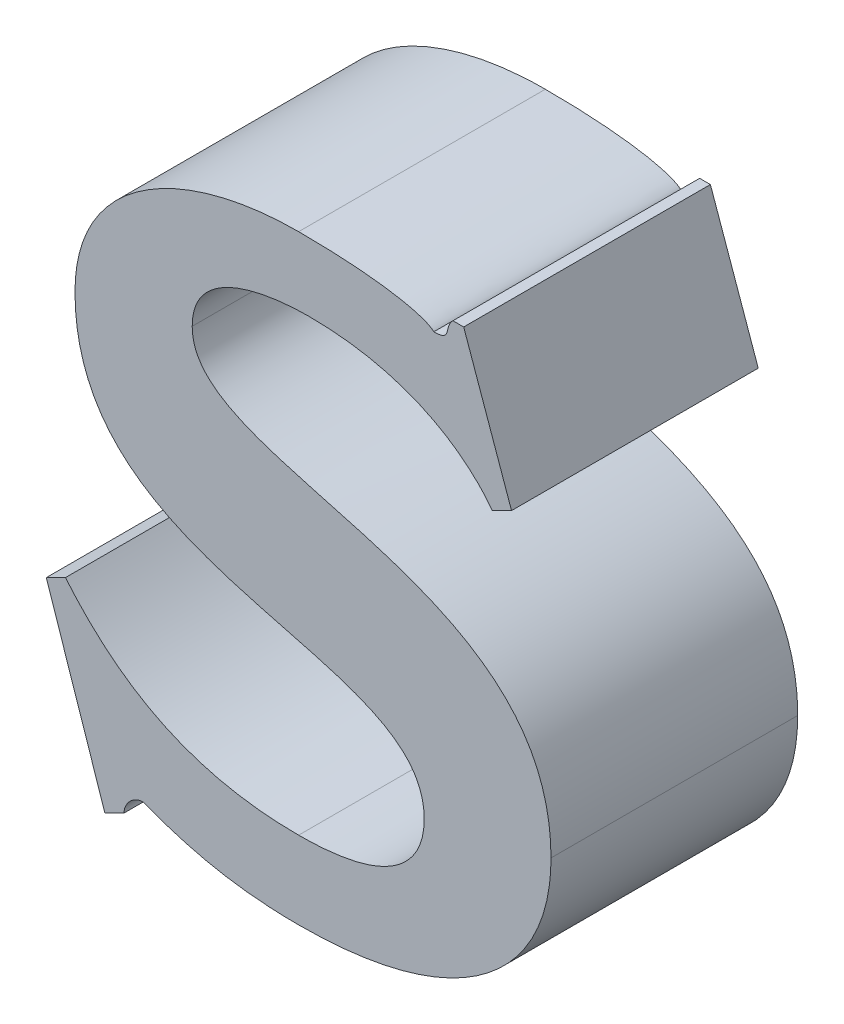
ISO-10303-21;
HEADER;
FILE_DESCRIPTION(('STEP AP214'),'2;1');
FILE_NAME('part.step','',(''),(''),'','','');
FILE_SCHEMA(('AUTOMOTIVE_DESIGN { 1 0 10303 214 1 1 1 1 }'));
ENDSEC;
DATA;
#1=APPLICATION_CONTEXT('core data for automotive mechanical design processes');
#2=APPLICATION_PROTOCOL_DEFINITION('international standard','automotive_design',2000,#1);
#3=PRODUCT_CONTEXT('',#1,'mechanical');
#4=PRODUCT('Part','Part','',(#3));
#5=PRODUCT_RELATED_PRODUCT_CATEGORY('part','',(#4));
#6=PRODUCT_DEFINITION_FORMATION('','',#4);
#7=PRODUCT_DEFINITION_CONTEXT('part definition',#1,'design');
#8=PRODUCT_DEFINITION('design','',#6,#7);
#9=PRODUCT_DEFINITION_SHAPE('','',#8);
#10=(LENGTH_UNIT() NAMED_UNIT(*) SI_UNIT(.MILLI.,.METRE.));
#11=(NAMED_UNIT(*) PLANE_ANGLE_UNIT() SI_UNIT($,.RADIAN.));
#12=(NAMED_UNIT(*) SI_UNIT($,.STERADIAN.) SOLID_ANGLE_UNIT());
#13=UNCERTAINTY_MEASURE_WITH_UNIT(LENGTH_MEASURE(1.E-05),#10,'distance_accuracy_value','');
#14=(GEOMETRIC_REPRESENTATION_CONTEXT(3) GLOBAL_UNCERTAINTY_ASSIGNED_CONTEXT((#13)) GLOBAL_UNIT_ASSIGNED_CONTEXT((#10,
#11,#12)) REPRESENTATION_CONTEXT('',''));
#15=CARTESIAN_POINT('',(0.,0.,0.));
#16=DIRECTION('',(0.,0.,1.));
#17=DIRECTION('',(1.,0.,0.));
#18=AXIS2_PLACEMENT_3D('',#15,#16,#17);
#19=CARTESIAN_POINT('',(3.0463504415638,0.00170300180043131,0.));
#20=DIRECTION('',(-0.447147128615408,0.894460421355241,0.));
#21=DIRECTION('',(-0.894460421355241,-0.447147128615408,0.));
#22=AXIS2_PLACEMENT_3D('',#19,#20,#21);
#23=PLANE('',#22);
#24=DIRECTION('',(0.894460421355241,0.447147128615408,0.));
#25=VECTOR('',#24,1.);
#26=CARTESIAN_POINT('',(3.0385924973305,-0.00217524971863377,0.));
#27=LINE('',#26,#25);
#28=CARTESIAN_POINT('',(3.0385924973305,-0.00217524971863377,0.));
#29=VERTEX_POINT('',#28);
#30=CARTESIAN_POINT('',(3.0463504415637,0.00170300180043131,0.));
#31=VERTEX_POINT('',#30);
#32=EDGE_CURVE('E11',#29,#31,#27,.T.);
#33=ORIENTED_EDGE('',*,*,#32,.F.);
#34=DIRECTION('',(0.,0.,1.));
#35=VECTOR('',#34,1.);
#36=CARTESIAN_POINT('',(3.0385924973305,-0.00217524971863377,0.));
#37=LINE('',#36,#35);
#38=CARTESIAN_POINT('',(3.0385924973305,-0.00217524971863377,0.1));
#39=VERTEX_POINT('',#38);
#40=EDGE_CURVE('E24',#29,#39,#37,.T.);
#41=ORIENTED_EDGE('',*,*,#40,.T.);
#42=DIRECTION('',(-0.894460421355241,-0.447147128615408,0.));
#43=VECTOR('',#42,1.);
#44=CARTESIAN_POINT('',(3.0385924973305,-0.00217524971863377,0.1));
#45=LINE('',#44,#43);
#46=CARTESIAN_POINT('',(3.0463504415637,0.00170300180043131,0.1));
#47=VERTEX_POINT('',#46);
#48=EDGE_CURVE('E160',#47,#39,#45,.T.);
#49=ORIENTED_EDGE('',*,*,#48,.F.);
#50=DIRECTION('',(0.,0.,1.));
#51=VECTOR('',#50,1.);
#52=CARTESIAN_POINT('',(3.0463504415637,0.00170300180043131,0.));
#53=LINE('',#52,#51);
#54=EDGE_CURVE('E398',#31,#47,#53,.T.);
#55=ORIENTED_EDGE('',*,*,#54,.F.);
#56=EDGE_LOOP('',(#33,#41,#49,#55));
#57=FACE_BOUND('',#56,.T.);
#58=ADVANCED_FACE('F17',(#57),#23,.T.);
#59=CARTESIAN_POINT('',(3.1408808407212,-0.0414418257613394,0.));
#60=CARTESIAN_POINT('',(3.1408808407212,-0.0414418257613394,0.1));
#61=CARTESIAN_POINT('',(3.0938568608924,-0.0414418257613952,0.));
#62=CARTESIAN_POINT('',(3.0938568608924,-0.0414418257613952,0.1));
#63=CARTESIAN_POINT('',(3.066225579858,-0.0220509284601061,0.));
#64=CARTESIAN_POINT('',(3.066225579858,-0.0220509284601061,0.1));
#65=CARTESIAN_POINT('',(3.0463504415637,0.00170300180043131,0.));
#66=CARTESIAN_POINT('',(3.0463504415637,0.00170300180043131,0.1));
#67=B_SPLINE_SURFACE_WITH_KNOTS('',3,1,((#59,#60),(#61,#62),(#63,#64),(#65,#66)),.UNSPECIFIED.,
.F.,.F.,.F.,(4,4),(2,2),(-1.,0.),(0.,0.01),.UNSPECIFIED.);
#68=CARTESIAN_POINT('',(3.0463504415637,0.00170300180043131,0.));
#69=CARTESIAN_POINT('',(3.066225579858,-0.0220509284601061,0.));
#70=CARTESIAN_POINT('',(3.0938568608924,-0.0414418257613952,0.));
#71=CARTESIAN_POINT('',(3.1408808407212,-0.0414418257613394,0.));
#72=B_SPLINE_CURVE_WITH_KNOTS('',3,(#68,#69,#70,#71),.UNSPECIFIED.,.F.,.F.,(4,4),(0.,1.),.UNSPECIFIED.);
#73=CARTESIAN_POINT('',(3.1408808407212,-0.0414418257613394,0.));
#74=VERTEX_POINT('',#73);
#75=EDGE_CURVE('E391',#31,#74,#72,.T.);
#76=CARTESIAN_POINT('',(3.1408808407212,-0.0414418257613394,0.1));
#77=CARTESIAN_POINT('',(3.0938568608924,-0.0414418257613952,0.1));
#78=CARTESIAN_POINT('',(3.066225579858,-0.0220509284601061,0.1));
#79=CARTESIAN_POINT('',(3.0463504415637,0.00170300180043131,0.1));
#80=B_SPLINE_CURVE_WITH_KNOTS('',3,(#76,#77,#78,#79),.UNSPECIFIED.,.F.,.F.,(4,4),(-1.,0.),.UNSPECIFIED.);
#81=CARTESIAN_POINT('',(3.1408808407212,-0.0414418257613394,0.1));
#82=VERTEX_POINT('',#81);
#83=EDGE_CURVE('E387',#82,#47,#80,.T.);
#84=DIRECTION('',(0.,0.,1.));
#85=VECTOR('',#84,1.);
#86=CARTESIAN_POINT('',(3.1408808407212,-0.0414418257613394,0.));
#87=LINE('',#86,#85);
#88=EDGE_CURVE('E381',#74,#82,#87,.T.);
#89=ORIENTED_EDGE('',*,*,#75,.F.);
#90=ORIENTED_EDGE('',*,*,#54,.T.);
#91=ORIENTED_EDGE('',*,*,#83,.F.);
#92=ORIENTED_EDGE('',*,*,#88,.F.);
#93=EDGE_LOOP('',(#89,#90,#91,#92));
#94=FACE_BOUND('',#93,.T.);
#95=ADVANCED_FACE('F463',(#94),#67,.T.);
#96=CARTESIAN_POINT('',(3.1917809102784,-0.0104162819904138,0.));
#97=CARTESIAN_POINT('',(3.1917809102784,-0.0104162819904138,0.1));
#98=CARTESIAN_POINT('',(3.1917809108365,-0.0259290376917904,0.));
#99=CARTESIAN_POINT('',(3.1917809108365,-0.0259290376917904,0.1));
#100=CARTESIAN_POINT('',(3.1801472366141,-0.0414418271739219,0.));
#101=CARTESIAN_POINT('',(3.1801472366141,-0.0414418271739219,0.1));
#102=CARTESIAN_POINT('',(3.1408808407212,-0.0414418257613394,0.));
#103=CARTESIAN_POINT('',(3.1408808407212,-0.0414418257613394,0.1));
#104=B_SPLINE_SURFACE_WITH_KNOTS('',3,1,((#96,#97),(#98,#99),(#100,#101),(#102,#103)),
.UNSPECIFIED.,.F.,.F.,.F.,(4,4),(2,2),(-1.,0.),(0.,0.01),.UNSPECIFIED.);
#105=CARTESIAN_POINT('',(3.1408808407212,-0.0414418257613394,0.));
#106=CARTESIAN_POINT('',(3.1801472366141,-0.0414418271739219,0.));
#107=CARTESIAN_POINT('',(3.1917809108365,-0.0259290376917904,0.));
#108=CARTESIAN_POINT('',(3.1917809102784,-0.0104162819904138,0.));
#109=B_SPLINE_CURVE_WITH_KNOTS('',3,(#105,#106,#107,#108),.UNSPECIFIED.,.F.,.F.,(4,4),(0.,1.),.UNSPECIFIED.);
#110=CARTESIAN_POINT('',(3.1917809102784,-0.0104162819904138,0.));
#111=VERTEX_POINT('',#110);
#112=EDGE_CURVE('E374',#74,#111,#109,.T.);
#113=CARTESIAN_POINT('',(3.1917809102784,-0.0104162819904138,0.1));
#114=CARTESIAN_POINT('',(3.1917809108365,-0.0259290376917904,0.1));
#115=CARTESIAN_POINT('',(3.1801472366141,-0.0414418271739219,0.1));
#116=CARTESIAN_POINT('',(3.1408808407212,-0.0414418257613394,0.1));
#117=B_SPLINE_CURVE_WITH_KNOTS('',3,(#113,#114,#115,#116),.UNSPECIFIED.,.F.,.F.,(4,4),(-1.,0.),.UNSPECIFIED.);
#118=CARTESIAN_POINT('',(3.1917809102784,-0.0104162819904138,0.1));
#119=VERTEX_POINT('',#118);
#120=EDGE_CURVE('E369',#119,#82,#117,.T.);
#121=DIRECTION('',(0.,0.,1.));
#122=VECTOR('',#121,1.);
#123=CARTESIAN_POINT('',(3.1917809102784,-0.0104162819904138,0.));
#124=LINE('',#123,#122);
#125=EDGE_CURVE('E363',#111,#119,#124,.T.);
#126=ORIENTED_EDGE('',*,*,#112,.F.);
#127=ORIENTED_EDGE('',*,*,#88,.T.);
#128=ORIENTED_EDGE('',*,*,#120,.F.);
#129=ORIENTED_EDGE('',*,*,#125,.F.);
#130=EDGE_LOOP('',(#126,#127,#128,#129));
#131=FACE_BOUND('',#130,.T.);
#132=ADVANCED_FACE('F459',(#131),#104,.T.);
#133=CARTESIAN_POINT('',(3.0502276121888,0.103989940027366,0.));
#134=CARTESIAN_POINT('',(3.0502276121888,0.103989940027366,0.1));
#135=CARTESIAN_POINT('',(3.0502276124849,0.00945925474084119,0.));
#136=CARTESIAN_POINT('',(3.0502276124849,0.00945925474084119,0.1));
#137=CARTESIAN_POINT('',(3.1917809111018,0.0448477212741324,0.));
#138=CARTESIAN_POINT('',(3.1917809111018,0.0448477212741324,0.1));
#139=CARTESIAN_POINT('',(3.1917809102784,-0.0104162819904138,0.));
#140=CARTESIAN_POINT('',(3.1917809102784,-0.0104162819904138,0.1));
#141=B_SPLINE_SURFACE_WITH_KNOTS('',3,1,((#133,#134),(#135,#136),(#137,#138),(#139,#140)),
.UNSPECIFIED.,.F.,.F.,.F.,(4,4),(2,2),(-1.,0.),(0.,0.01),.UNSPECIFIED.);
#142=CARTESIAN_POINT('',(3.1917809102784,-0.0104162819904138,0.));
#143=CARTESIAN_POINT('',(3.1917809111018,0.0448477212741324,0.));
#144=CARTESIAN_POINT('',(3.0502276124849,0.0094592547408412,0.));
#145=CARTESIAN_POINT('',(3.0502276121888,0.103989940027366,0.));
#146=B_SPLINE_CURVE_WITH_KNOTS('',3,(#142,#143,#144,#145),.UNSPECIFIED.,.F.,.F.,(4,4),(0.,1.),.UNSPECIFIED.);
#147=CARTESIAN_POINT('',(3.0502276121888,0.103989940027366,0.));
#148=VERTEX_POINT('',#147);
#149=EDGE_CURVE('E356',#111,#148,#146,.T.);
#150=CARTESIAN_POINT('',(3.0502276121888,0.103989940027366,0.1));
#151=CARTESIAN_POINT('',(3.0502276124849,0.0094592547408412,0.1));
#152=CARTESIAN_POINT('',(3.1917809111018,0.0448477212741324,0.1));
#153=CARTESIAN_POINT('',(3.1917809102784,-0.0104162819904138,0.1));
#154=B_SPLINE_CURVE_WITH_KNOTS('',3,(#150,#151,#152,#153),.UNSPECIFIED.,.F.,.F.,(4,4),(-1.,0.),.UNSPECIFIED.);
#155=CARTESIAN_POINT('',(3.0502276121888,0.103989940027366,0.1));
#156=VERTEX_POINT('',#155);
#157=EDGE_CURVE('E351',#156,#119,#154,.T.);
#158=DIRECTION('',(0.,0.,1.));
#159=VECTOR('',#158,1.);
#160=CARTESIAN_POINT('',(3.0502276121888,0.103989940027366,0.));
#161=LINE('',#160,#159);
#162=EDGE_CURVE('E345',#148,#156,#161,.T.);
#163=ORIENTED_EDGE('',*,*,#149,.F.);
#164=ORIENTED_EDGE('',*,*,#125,.T.);
#165=ORIENTED_EDGE('',*,*,#157,.F.);
#166=ORIENTED_EDGE('',*,*,#162,.F.);
#167=EDGE_LOOP('',(#163,#164,#165,#166));
#168=FACE_BOUND('',#167,.T.);
#169=ADVANCED_FACE('F455',(#168),#141,.T.);
#170=CARTESIAN_POINT('',(3.1408808407212,0.170403808321217,0.));
#171=CARTESIAN_POINT('',(3.1408808407212,0.170403808321217,0.1));
#172=CARTESIAN_POINT('',(3.0938568604829,0.170403808590567,0.));
#173=CARTESIAN_POINT('',(3.0938568604829,0.170403808590567,0.1));
#174=CARTESIAN_POINT('',(3.0502276119226,0.147134659499865,0.));
#175=CARTESIAN_POINT('',(3.0502276119226,0.147134659499865,0.1));
#176=CARTESIAN_POINT('',(3.0502276121888,0.103989940027366,0.));
#177=CARTESIAN_POINT('',(3.0502276121888,0.103989940027366,0.1));
#178=B_SPLINE_SURFACE_WITH_KNOTS('',3,1,((#170,#171),(#172,#173),(#174,#175),(#176,#177)),
.UNSPECIFIED.,.F.,.F.,.F.,(4,4),(2,2),(-1.,0.),(0.,0.01),.UNSPECIFIED.);
#179=CARTESIAN_POINT('',(3.0502276121888,0.103989940027366,0.));
#180=CARTESIAN_POINT('',(3.0502276119226,0.147134659499865,0.));
#181=CARTESIAN_POINT('',(3.0938568604829,0.170403808590567,0.));
#182=CARTESIAN_POINT('',(3.1408808407212,0.170403808321217,0.));
#183=B_SPLINE_CURVE_WITH_KNOTS('',3,(#179,#180,#181,#182),.UNSPECIFIED.,.F.,.F.,(4,4),(0.,1.),.UNSPECIFIED.);
#184=CARTESIAN_POINT('',(3.1408808407212,0.170403808321217,0.));
#185=VERTEX_POINT('',#184);
#186=EDGE_CURVE('E338',#148,#185,#183,.T.);
#187=CARTESIAN_POINT('',(3.1408808407212,0.170403808321217,0.1));
#188=CARTESIAN_POINT('',(3.0938568604829,0.170403808590567,0.1));
#189=CARTESIAN_POINT('',(3.0502276119226,0.147134659499865,0.1));
#190=CARTESIAN_POINT('',(3.0502276121888,0.103989940027366,0.1));
#191=B_SPLINE_CURVE_WITH_KNOTS('',3,(#187,#188,#189,#190),.UNSPECIFIED.,.F.,.F.,(4,4),(-1.,0.),.UNSPECIFIED.);
#192=CARTESIAN_POINT('',(3.1408808407212,0.170403808321217,0.1));
#193=VERTEX_POINT('',#192);
#194=EDGE_CURVE('E333',#193,#156,#191,.T.);
#195=DIRECTION('',(0.,0.,1.));
#196=VECTOR('',#195,1.);
#197=CARTESIAN_POINT('',(3.1408808407212,0.170403808321217,0.));
#198=LINE('',#197,#196);
#199=EDGE_CURVE('E327',#185,#193,#198,.T.);
#200=ORIENTED_EDGE('',*,*,#186,.F.);
#201=ORIENTED_EDGE('',*,*,#162,.T.);
#202=ORIENTED_EDGE('',*,*,#194,.F.);
#203=ORIENTED_EDGE('',*,*,#199,.F.);
#204=EDGE_LOOP('',(#200,#201,#202,#203));
#205=FACE_BOUND('',#204,.T.);
#206=ADVANCED_FACE('F451',(#205),#178,.T.);
#207=CARTESIAN_POINT('',(3.1956598823951,0.162647413370297,0.));
#208=CARTESIAN_POINT('',(3.1956598823951,0.162647413370297,0.1));
#209=CARTESIAN_POINT('',(3.1917809103021,0.166525701234888,0.));
#210=CARTESIAN_POINT('',(3.1917809103021,0.166525701234888,0.1));
#211=CARTESIAN_POINT('',(3.1723910938727,0.170403808515751,0.));
#212=CARTESIAN_POINT('',(3.1723910938727,0.170403808515751,0.1));
#213=CARTESIAN_POINT('',(3.1408808407212,0.170403808321217,0.));
#214=CARTESIAN_POINT('',(3.1408808407212,0.170403808321217,0.1));
#215=B_SPLINE_SURFACE_WITH_KNOTS('',3,1,((#207,#208),(#209,#210),(#211,#212),(#213,#214)),
.UNSPECIFIED.,.F.,.F.,.F.,(4,4),(2,2),(-1.,0.),(0.,0.01),.UNSPECIFIED.);
#216=CARTESIAN_POINT('',(3.1408808407212,0.170403808321217,0.));
#217=CARTESIAN_POINT('',(3.1723910938727,0.170403808515751,0.));
#218=CARTESIAN_POINT('',(3.1917809103021,0.166525701234888,0.));
#219=CARTESIAN_POINT('',(3.1956598823951,0.162647413370297,0.));
#220=B_SPLINE_CURVE_WITH_KNOTS('',3,(#216,#217,#218,#219),.UNSPECIFIED.,.F.,.F.,(4,4),(0.,1.),.UNSPECIFIED.);
#221=CARTESIAN_POINT('',(3.1956598823951,0.162647413370297,0.));
#222=VERTEX_POINT('',#221);
#223=EDGE_CURVE('E320',#185,#222,#220,.T.);
#224=CARTESIAN_POINT('',(3.1956598823951,0.162647413370297,0.1));
#225=CARTESIAN_POINT('',(3.1917809103021,0.166525701234888,0.1));
#226=CARTESIAN_POINT('',(3.1723910938727,0.170403808515751,0.1));
#227=CARTESIAN_POINT('',(3.1408808407212,0.170403808321217,0.1));
#228=B_SPLINE_CURVE_WITH_KNOTS('',3,(#224,#225,#226,#227),.UNSPECIFIED.,.F.,.F.,(4,4),(-1.,0.),.UNSPECIFIED.);
#229=CARTESIAN_POINT('',(3.1956598823951,0.162647413370297,0.1));
#230=VERTEX_POINT('',#229);
#231=EDGE_CURVE('E315',#230,#193,#228,.T.);
#232=DIRECTION('',(0.,0.,1.));
#233=VECTOR('',#232,1.);
#234=CARTESIAN_POINT('',(3.1956598823951,0.162647413370297,0.));
#235=LINE('',#234,#233);
#236=EDGE_CURVE('E309',#222,#230,#235,.T.);
#237=ORIENTED_EDGE('',*,*,#223,.F.);
#238=ORIENTED_EDGE('',*,*,#199,.T.);
#239=ORIENTED_EDGE('',*,*,#231,.F.);
#240=ORIENTED_EDGE('',*,*,#236,.F.);
#241=EDGE_LOOP('',(#237,#238,#239,#240));
#242=FACE_BOUND('',#241,.T.);
#243=ADVANCED_FACE('F447',(#242),#215,.T.);
#244=CARTESIAN_POINT('',(3.2034160251367,0.170403808321217,0.));
#245=CARTESIAN_POINT('',(3.2034160251367,0.170403808321217,0.1));
#246=CARTESIAN_POINT('',(3.1995370530197,0.166525700920871,0.));
#247=CARTESIAN_POINT('',(3.1995370530197,0.166525700920871,0.1));
#248=CARTESIAN_POINT('',(3.2034160251369,0.162647413370146,0.));
#249=CARTESIAN_POINT('',(3.2034160251369,0.162647413370146,0.1));
#250=CARTESIAN_POINT('',(3.1956598823951,0.162647413370297,0.));
#251=CARTESIAN_POINT('',(3.1956598823951,0.162647413370297,0.1));
#252=B_SPLINE_SURFACE_WITH_KNOTS('',3,1,((#244,#245),(#246,#247),(#248,#249),(#250,#251)),
.UNSPECIFIED.,.F.,.F.,.F.,(4,4),(2,2),(-1.,0.),(0.,0.01),.UNSPECIFIED.);
#253=CARTESIAN_POINT('',(3.1956598823951,0.162647413370297,0.));
#254=CARTESIAN_POINT('',(3.2034160251369,0.162647413370146,0.));
#255=CARTESIAN_POINT('',(3.1995370530197,0.166525700920871,0.));
#256=CARTESIAN_POINT('',(3.2034160251367,0.170403808321217,0.));
#257=B_SPLINE_CURVE_WITH_KNOTS('',3,(#253,#254,#255,#256),.UNSPECIFIED.,.F.,.F.,(4,4),(0.,1.),.UNSPECIFIED.);
#258=CARTESIAN_POINT('',(3.2034160251367,0.170403808321217,0.));
#259=VERTEX_POINT('',#258);
#260=EDGE_CURVE('E302',#222,#259,#257,.T.);
#261=CARTESIAN_POINT('',(3.2034160251367,0.170403808321217,0.1));
#262=CARTESIAN_POINT('',(3.1995370530197,0.166525700920871,0.1));
#263=CARTESIAN_POINT('',(3.2034160251369,0.162647413370146,0.1));
#264=CARTESIAN_POINT('',(3.1956598823951,0.162647413370297,0.1));
#265=B_SPLINE_CURVE_WITH_KNOTS('',3,(#261,#262,#263,#264),.UNSPECIFIED.,.F.,.F.,(4,4),(-1.,0.),.UNSPECIFIED.);
#266=CARTESIAN_POINT('',(3.2034160251367,0.170403808321217,0.1));
#267=VERTEX_POINT('',#266);
#268=EDGE_CURVE('E297',#267,#230,#265,.T.);
#269=DIRECTION('',(0.,0.,1.));
#270=VECTOR('',#269,1.);
#271=CARTESIAN_POINT('',(3.2034160251367,0.170403808321217,0.));
#272=LINE('',#271,#270);
#273=EDGE_CURVE('E294',#259,#267,#272,.T.);
#274=ORIENTED_EDGE('',*,*,#260,.F.);
#275=ORIENTED_EDGE('',*,*,#236,.T.);
#276=ORIENTED_EDGE('',*,*,#268,.F.);
#277=ORIENTED_EDGE('',*,*,#273,.F.);
#278=EDGE_LOOP('',(#274,#275,#276,#277));
#279=FACE_BOUND('',#278,.T.);
#280=ADVANCED_FACE('F443',(#279),#252,.T.);
#281=CARTESIAN_POINT('',(3.2077785176488,0.170403808321217,0.));
#282=DIRECTION('',(0.,1.,0.));
#283=DIRECTION('',(-1.,0.,0.));
#284=AXIS2_PLACEMENT_3D('',#281,#282,#283);
#285=PLANE('',#284);
#286=DIRECTION('',(1.,0.,0.));
#287=VECTOR('',#286,1.);
#288=CARTESIAN_POINT('',(3.2034160251367,0.170403808321217,0.));
#289=LINE('',#288,#287);
#290=CARTESIAN_POINT('',(3.2077785176488,0.170403808321217,0.));
#291=VERTEX_POINT('',#290);
#292=EDGE_CURVE('E292',#259,#291,#289,.T.);
#293=ORIENTED_EDGE('',*,*,#292,.F.);
#294=ORIENTED_EDGE('',*,*,#273,.T.);
#295=DIRECTION('',(-1.,0.,0.));
#296=VECTOR('',#295,1.);
#297=CARTESIAN_POINT('',(3.2034160251367,0.170403808321217,0.1));
#298=LINE('',#297,#296);
#299=CARTESIAN_POINT('',(3.2077785176488,0.170403808321217,0.1));
#300=VERTEX_POINT('',#299);
#301=EDGE_CURVE('E289',#300,#267,#298,.T.);
#302=ORIENTED_EDGE('',*,*,#301,.F.);
#303=DIRECTION('',(0.,0.,1.));
#304=VECTOR('',#303,1.);
#305=CARTESIAN_POINT('',(3.2077785176488,0.170403808321217,0.));
#306=LINE('',#305,#304);
#307=EDGE_CURVE('E286',#291,#300,#306,.T.);
#308=ORIENTED_EDGE('',*,*,#307,.F.);
#309=EDGE_LOOP('',(#293,#294,#302,#308));
#310=FACE_BOUND('',#309,.T.);
#311=ADVANCED_FACE('F439',(#310),#285,.T.);
#312=CARTESIAN_POINT('',(3.2271701355464,0.115624478407832,0.));
#313=DIRECTION('',(0.942678091152359,0.333703485839368,0.));
#314=DIRECTION('',(-0.333703485839368,0.942678091152359,0.));
#315=AXIS2_PLACEMENT_3D('',#312,#313,#314);
#316=PLANE('',#315);
#317=DIRECTION('',(0.333703485839368,-0.942678091152359,0.));
#318=VECTOR('',#317,1.);
#319=CARTESIAN_POINT('',(3.2077785176488,0.170403808321217,0.));
#320=LINE('',#319,#318);
#321=CARTESIAN_POINT('',(3.2271701355464,0.115624478407832,0.));
#322=VERTEX_POINT('',#321);
#323=EDGE_CURVE('E284',#291,#322,#320,.T.);
#324=ORIENTED_EDGE('',*,*,#323,.F.);
#325=ORIENTED_EDGE('',*,*,#307,.T.);
#326=DIRECTION('',(-0.333703485839368,0.942678091152359,0.));
#327=VECTOR('',#326,1.);
#328=CARTESIAN_POINT('',(3.2077785176488,0.170403808321217,0.1));
#329=LINE('',#328,#327);
#330=CARTESIAN_POINT('',(3.2271701355464,0.115624478407832,0.1));
#331=VERTEX_POINT('',#330);
#332=EDGE_CURVE('E281',#331,#300,#329,.T.);
#333=ORIENTED_EDGE('',*,*,#332,.F.);
#334=DIRECTION('',(0.,0.,1.));
#335=VECTOR('',#334,1.);
#336=CARTESIAN_POINT('',(3.2271701355464,0.115624478407832,0.));
#337=LINE('',#336,#335);
#338=EDGE_CURVE('E278',#322,#331,#337,.T.);
#339=ORIENTED_EDGE('',*,*,#338,.F.);
#340=EDGE_LOOP('',(#324,#325,#333,#339));
#341=FACE_BOUND('',#340,.T.);
#342=ADVANCED_FACE('F435',(#341),#316,.T.);
#343=CARTESIAN_POINT('',(3.2194136325071,0.111746334977132,0.));
#344=DIRECTION('',(0.447203624151044,-0.894432176604896,0.));
#345=DIRECTION('',(0.894432176604896,0.447203624151044,0.));
#346=AXIS2_PLACEMENT_3D('',#343,#344,#345);
#347=PLANE('',#346);
#348=DIRECTION('',(-0.894432176604896,-0.447203624151044,0.));
#349=VECTOR('',#348,1.);
#350=CARTESIAN_POINT('',(3.2271701355464,0.115624478407832,0.));
#351=LINE('',#350,#349);
#352=CARTESIAN_POINT('',(3.2194136325071,0.111746334977132,0.));
#353=VERTEX_POINT('',#352);
#354=EDGE_CURVE('E276',#322,#353,#351,.T.);
#355=ORIENTED_EDGE('',*,*,#354,.F.);
#356=ORIENTED_EDGE('',*,*,#338,.T.);
#357=DIRECTION('',(0.894432176604896,0.447203624151044,0.));
#358=VECTOR('',#357,1.);
#359=CARTESIAN_POINT('',(3.2271701355464,0.115624478407832,0.1));
#360=LINE('',#359,#358);
#361=CARTESIAN_POINT('',(3.2194136325071,0.111746334977132,0.1));
#362=VERTEX_POINT('',#361);
#363=EDGE_CURVE('E273',#362,#331,#360,.T.);
#364=ORIENTED_EDGE('',*,*,#363,.F.);
#365=DIRECTION('',(0.,0.,1.));
#366=VECTOR('',#365,1.);
#367=CARTESIAN_POINT('',(3.2194136325071,0.111746334977132,0.));
#368=LINE('',#367,#366);
#369=EDGE_CURVE('E267',#353,#362,#368,.T.);
#370=ORIENTED_EDGE('',*,*,#369,.F.);
#371=EDGE_LOOP('',(#355,#356,#364,#370));
#372=FACE_BOUND('',#371,.T.);
#373=ADVANCED_FACE('F431',(#372),#347,.T.);
#374=CARTESIAN_POINT('',(3.1447583716438,0.142771734629687,0.));
#375=CARTESIAN_POINT('',(3.1447583716438,0.142771734629687,0.1));
#376=CARTESIAN_POINT('',(3.1623964735484,0.142771737032679,0.));
#377=CARTESIAN_POINT('',(3.1623964735484,0.142771737032679,0.1));
#378=CARTESIAN_POINT('',(3.1769279771014,0.139641980100609,0.));
#379=CARTESIAN_POINT('',(3.1769279771014,0.139641980100609,0.1));
#380=CARTESIAN_POINT('',(3.1951964582252,0.132037886436416,0.));
#381=CARTESIAN_POINT('',(3.1951964582252,0.132037886436416,0.1));
#382=CARTESIAN_POINT('',(3.2013980901704,0.128546218407649,0.));
#383=CARTESIAN_POINT('',(3.2013980901704,0.128546218407649,0.1));
#384=CARTESIAN_POINT('',(3.2116579013345,0.12061844350881,0.));
#385=CARTESIAN_POINT('',(3.2116579013345,0.12061844350881,0.1));
#386=CARTESIAN_POINT('',(3.2158946827333,0.116438057746347,0.));
#387=CARTESIAN_POINT('',(3.2158946827333,0.116438057746347,0.1));
#388=CARTESIAN_POINT('',(3.2194136325071,0.111746334977132,0.));
#389=CARTESIAN_POINT('',(3.2194136325071,0.111746334977132,0.1));
#390=B_SPLINE_SURFACE_WITH_KNOTS('',3,1,((#374,#375),(#376,#377),(#378,#379),(#380,#381),(#382,
#383),(#384,#385),(#386,#387),(#388,#389)),.UNSPECIFIED.,.F.,.F.,.F.,(4,2,2,4),(2,2),
(-0.0066235438387581,-0.0033508001984094,-0.0015233111898169,0.),(0.,0.01),.UNSPECIFIED.);
#391=CARTESIAN_POINT('',(3.2194136325071,0.111746334977132,0.));
#392=CARTESIAN_POINT('',(3.2158946827333,0.116438057746347,0.));
#393=CARTESIAN_POINT('',(3.2116579013345,0.12061844350881,0.));
#394=CARTESIAN_POINT('',(3.2013980901704,0.128546218407649,0.));
#395=CARTESIAN_POINT('',(3.1951964582252,0.132037886436416,0.));
#396=CARTESIAN_POINT('',(3.1769279771014,0.139641980100609,0.));
#397=CARTESIAN_POINT('',(3.1623964735484,0.142771737032679,0.));
#398=CARTESIAN_POINT('',(3.1447583716438,0.142771734629687,0.));
#399=B_SPLINE_CURVE_WITH_KNOTS('',3,(#391,#392,#393,#394,#395,#396,#397,#398),.UNSPECIFIED.,.F.,
.F.,(4,2,2,4),(0.,0.0015233111898169,0.0033508001984094,0.0066235438387581),.UNSPECIFIED.);
#400=CARTESIAN_POINT('',(3.1447583716438,0.142771734629687,0.));
#401=VERTEX_POINT('',#400);
#402=EDGE_CURVE('E260',#353,#401,#399,.T.);
#403=CARTESIAN_POINT('',(3.1447583716438,0.142771734629687,0.1));
#404=CARTESIAN_POINT('',(3.1623964735484,0.142771737032679,0.1));
#405=CARTESIAN_POINT('',(3.1769279771014,0.139641980100609,0.1));
#406=CARTESIAN_POINT('',(3.1951964582252,0.132037886436416,0.1));
#407=CARTESIAN_POINT('',(3.2013980901704,0.128546218407649,0.1));
#408=CARTESIAN_POINT('',(3.2116579013345,0.12061844350881,0.1));
#409=CARTESIAN_POINT('',(3.2158946827333,0.116438057746347,0.1));
#410=CARTESIAN_POINT('',(3.2194136325071,0.111746334977132,0.1));
#411=B_SPLINE_CURVE_WITH_KNOTS('',3,(#403,#404,#405,#406,#407,#408,#409,#410),.UNSPECIFIED.,.F.,
.F.,(4,2,2,4),(-0.0066235438387581,-0.0033508001984094,-0.0015233111898169,0.),.UNSPECIFIED.);
#412=CARTESIAN_POINT('',(3.1447583716438,0.142771734629687,0.1));
#413=VERTEX_POINT('',#412);
#414=EDGE_CURVE('E255',#413,#362,#411,.T.);
#415=DIRECTION('',(0.,0.,1.));
#416=VECTOR('',#415,1.);
#417=CARTESIAN_POINT('',(3.1447583716438,0.142771734629687,0.));
#418=LINE('',#417,#416);
#419=EDGE_CURVE('E249',#401,#413,#418,.T.);
#420=ORIENTED_EDGE('',*,*,#402,.F.);
#421=ORIENTED_EDGE('',*,*,#369,.T.);
#422=ORIENTED_EDGE('',*,*,#414,.F.);
#423=ORIENTED_EDGE('',*,*,#419,.F.);
#424=EDGE_LOOP('',(#420,#421,#422,#423));
#425=FACE_BOUND('',#424,.T.);
#426=ADVANCED_FACE('F427',(#425),#390,.T.);
#427=CARTESIAN_POINT('',(3.0977354727104,0.115624478407832,0.));
#428=CARTESIAN_POINT('',(3.0977354727104,0.115624478407832,0.1));
#429=CARTESIAN_POINT('',(3.0977354725469,0.138893629211212,0.));
#430=CARTESIAN_POINT('',(3.0977354725469,0.138893629211212,0.1));
#431=CARTESIAN_POINT('',(3.1292457258625,0.142771735283506,0.));
#432=CARTESIAN_POINT('',(3.1292457258625,0.142771735283506,0.1));
#433=CARTESIAN_POINT('',(3.1447583716438,0.142771734629687,0.));
#434=CARTESIAN_POINT('',(3.1447583716438,0.142771734629687,0.1));
#435=B_SPLINE_SURFACE_WITH_KNOTS('',3,1,((#427,#428),(#429,#430),(#431,#432),(#433,#434)),
.UNSPECIFIED.,.F.,.F.,.F.,(4,4),(2,2),(-1.,0.),(0.,0.01),.UNSPECIFIED.);
#436=CARTESIAN_POINT('',(3.1447583716438,0.142771734629687,0.));
#437=CARTESIAN_POINT('',(3.1292457258625,0.142771735283506,0.));
#438=CARTESIAN_POINT('',(3.0977354725469,0.138893629211212,0.));
#439=CARTESIAN_POINT('',(3.0977354727104,0.115624478407832,0.));
#440=B_SPLINE_CURVE_WITH_KNOTS('',3,(#436,#437,#438,#439),.UNSPECIFIED.,.F.,.F.,(4,4),(0.,1.),.UNSPECIFIED.);
#441=CARTESIAN_POINT('',(3.0977354727104,0.115624478407832,0.));
#442=VERTEX_POINT('',#441);
#443=EDGE_CURVE('E242',#401,#442,#440,.T.);
#444=CARTESIAN_POINT('',(3.0977354727104,0.115624478407832,0.1));
#445=CARTESIAN_POINT('',(3.0977354725469,0.138893629211212,0.1));
#446=CARTESIAN_POINT('',(3.1292457258625,0.142771735283506,0.1));
#447=CARTESIAN_POINT('',(3.1447583716438,0.142771734629687,0.1));
#448=B_SPLINE_CURVE_WITH_KNOTS('',3,(#444,#445,#446,#447),.UNSPECIFIED.,.F.,.F.,(4,4),(-1.,0.),.UNSPECIFIED.);
#449=CARTESIAN_POINT('',(3.0977354727104,0.115624478407832,0.1));
#450=VERTEX_POINT('',#449);
#451=EDGE_CURVE('E237',#450,#413,#448,.T.);
#452=DIRECTION('',(0.,0.,1.));
#453=VECTOR('',#452,1.);
#454=CARTESIAN_POINT('',(3.0977354727104,0.115624478407832,0.));
#455=LINE('',#454,#453);
#456=EDGE_CURVE('E231',#442,#450,#455,.T.);
#457=ORIENTED_EDGE('',*,*,#443,.F.);
#458=ORIENTED_EDGE('',*,*,#419,.T.);
#459=ORIENTED_EDGE('',*,*,#451,.F.);
#460=ORIENTED_EDGE('',*,*,#456,.F.);
#461=EDGE_LOOP('',(#457,#458,#459,#460));
#462=FACE_BOUND('',#461,.T.);
#463=ADVANCED_FACE('F423',(#462),#435,.T.);
#464=CARTESIAN_POINT('',(3.2431677429167,0.00170300180043131,0.));
#465=CARTESIAN_POINT('',(3.2431677429167,0.00170300180043131,0.1));
#466=CARTESIAN_POINT('',(3.2431677429167,0.095748799667293,0.));
#467=CARTESIAN_POINT('',(3.2431677429167,0.095748799667293,0.1));
#468=CARTESIAN_POINT('',(3.0977354727105,0.0686015074151749,0.));
#469=CARTESIAN_POINT('',(3.0977354727105,0.0686015074151749,0.1));
#470=CARTESIAN_POINT('',(3.0977354727104,0.115624478407832,0.));
#471=CARTESIAN_POINT('',(3.0977354727104,0.115624478407832,0.1));
#472=B_SPLINE_SURFACE_WITH_KNOTS('',3,1,((#464,#465),(#466,#467),(#468,#469),(#470,#471)),
.UNSPECIFIED.,.F.,.F.,.F.,(4,4),(2,2),(-1.,0.),(0.,0.01),.UNSPECIFIED.);
#473=CARTESIAN_POINT('',(3.0977354727104,0.115624478407832,0.));
#474=CARTESIAN_POINT('',(3.0977354727105,0.0686015074151749,0.));
#475=CARTESIAN_POINT('',(3.2431677429167,0.095748799667293,0.));
#476=CARTESIAN_POINT('',(3.2431677429167,0.00170300180043131,0.));
#477=B_SPLINE_CURVE_WITH_KNOTS('',3,(#473,#474,#475,#476),.UNSPECIFIED.,.F.,.F.,(4,4),(0.,1.),.UNSPECIFIED.);
#478=CARTESIAN_POINT('',(3.2431677429167,0.00170300180043131,0.));
#479=VERTEX_POINT('',#478);
#480=EDGE_CURVE('E224',#442,#479,#477,.T.);
#481=CARTESIAN_POINT('',(3.2431677429167,0.00170300180043131,0.1));
#482=CARTESIAN_POINT('',(3.2431677429167,0.095748799667293,0.1));
#483=CARTESIAN_POINT('',(3.0977354727105,0.0686015074151749,0.1));
#484=CARTESIAN_POINT('',(3.0977354727104,0.115624478407832,0.1));
#485=B_SPLINE_CURVE_WITH_KNOTS('',3,(#481,#482,#483,#484),.UNSPECIFIED.,.F.,.F.,(4,4),(-1.,0.),.UNSPECIFIED.);
#486=CARTESIAN_POINT('',(3.2431677429167,0.00170300180043131,0.1));
#487=VERTEX_POINT('',#486);
#488=EDGE_CURVE('E219',#487,#450,#485,.T.);
#489=DIRECTION('',(0.,0.,1.));
#490=VECTOR('',#489,1.);
#491=CARTESIAN_POINT('',(3.2431677429167,0.00170300180043131,0.));
#492=LINE('',#491,#490);
#493=EDGE_CURVE('E213',#479,#487,#492,.T.);
#494=ORIENTED_EDGE('',*,*,#480,.F.);
#495=ORIENTED_EDGE('',*,*,#456,.T.);
#496=ORIENTED_EDGE('',*,*,#488,.F.);
#497=ORIENTED_EDGE('',*,*,#493,.F.);
#498=EDGE_LOOP('',(#494,#495,#496,#497));
#499=FACE_BOUND('',#498,.T.);
#500=ADVANCED_FACE('F419',(#499),#472,.T.);
#501=CARTESIAN_POINT('',(3.1408808407212,-0.0729520068533557,0.));
#502=CARTESIAN_POINT('',(3.1408808407212,-0.0729520068533557,0.1));
#503=CARTESIAN_POINT('',(3.2077785187614,-0.0729520073806107,0.));
#504=CARTESIAN_POINT('',(3.2077785187614,-0.0729520073806107,0.1));
#505=CARTESIAN_POINT('',(3.2431677435597,-0.0414418257613918,0.));
#506=CARTESIAN_POINT('',(3.2431677435597,-0.0414418257613918,0.1));
#507=CARTESIAN_POINT('',(3.2431677429167,0.00170300180043131,0.));
#508=CARTESIAN_POINT('',(3.2431677429167,0.00170300180043131,0.1));
#509=B_SPLINE_SURFACE_WITH_KNOTS('',3,1,((#501,#502),(#503,#504),(#505,#506),(#507,#508)),
.UNSPECIFIED.,.F.,.F.,.F.,(4,4),(2,2),(-1.,0.),(0.,0.01),.UNSPECIFIED.);
#510=CARTESIAN_POINT('',(3.2431677429167,0.00170300180043131,0.));
#511=CARTESIAN_POINT('',(3.2431677435597,-0.0414418257613917,0.));
#512=CARTESIAN_POINT('',(3.2077785187614,-0.0729520073806107,0.));
#513=CARTESIAN_POINT('',(3.1408808407212,-0.0729520068533557,0.));
#514=B_SPLINE_CURVE_WITH_KNOTS('',3,(#510,#511,#512,#513),.UNSPECIFIED.,.F.,.F.,(4,4),(0.,1.),.UNSPECIFIED.);
#515=CARTESIAN_POINT('',(3.1408808407212,-0.0729520068533557,0.));
#516=VERTEX_POINT('',#515);
#517=EDGE_CURVE('E206',#479,#516,#514,.T.);
#518=CARTESIAN_POINT('',(3.1408808407212,-0.0729520068533557,0.1));
#519=CARTESIAN_POINT('',(3.2077785187614,-0.0729520073806107,0.1));
#520=CARTESIAN_POINT('',(3.2431677435597,-0.0414418257613917,0.1));
#521=CARTESIAN_POINT('',(3.2431677429167,0.00170300180043131,0.1));
#522=B_SPLINE_CURVE_WITH_KNOTS('',3,(#518,#519,#520,#521),.UNSPECIFIED.,.F.,.F.,(4,4),(-1.,0.),.UNSPECIFIED.);
#523=CARTESIAN_POINT('',(3.1408808407212,-0.0729520068533557,0.1));
#524=VERTEX_POINT('',#523);
#525=EDGE_CURVE('E201',#524,#487,#522,.T.);
#526=DIRECTION('',(0.,0.,1.));
#527=VECTOR('',#526,1.);
#528=CARTESIAN_POINT('',(3.1408808407212,-0.0729520068533557,0.));
#529=LINE('',#528,#527);
#530=EDGE_CURVE('E195',#516,#524,#529,.T.);
#531=ORIENTED_EDGE('',*,*,#517,.F.);
#532=ORIENTED_EDGE('',*,*,#493,.T.);
#533=ORIENTED_EDGE('',*,*,#525,.F.);
#534=ORIENTED_EDGE('',*,*,#530,.F.);
#535=EDGE_LOOP('',(#531,#532,#533,#534));
#536=FACE_BOUND('',#535,.T.);
#537=ADVANCED_FACE('F415',(#536),#509,.T.);
#538=CARTESIAN_POINT('',(3.0778603344174,-0.0613175045024918,0.));
#539=CARTESIAN_POINT('',(3.0778603344174,-0.0613175045024918,0.1));
#540=CARTESIAN_POINT('',(3.0977354727924,-0.0690738985436437,0.));
#541=CARTESIAN_POINT('',(3.0977354727924,-0.0690738985436437,0.1));
#542=CARTESIAN_POINT('',(3.1171270906089,-0.0729520063527307,0.));
#543=CARTESIAN_POINT('',(3.1171270906089,-0.0729520063527307,0.1));
#544=CARTESIAN_POINT('',(3.1408808407212,-0.0729520068533557,0.));
#545=CARTESIAN_POINT('',(3.1408808407212,-0.0729520068533557,0.1));
#546=B_SPLINE_SURFACE_WITH_KNOTS('',3,1,((#538,#539),(#540,#541),(#542,#543),(#544,#545)),
.UNSPECIFIED.,.F.,.F.,.F.,(4,4),(2,2),(-1.,0.),(0.,0.01),.UNSPECIFIED.);
#547=CARTESIAN_POINT('',(3.1408808407212,-0.0729520068533557,0.));
#548=CARTESIAN_POINT('',(3.1171270906089,-0.0729520063527307,0.));
#549=CARTESIAN_POINT('',(3.0977354727924,-0.0690738985436437,0.));
#550=CARTESIAN_POINT('',(3.0778603344174,-0.0613175045024918,0.));
#551=B_SPLINE_CURVE_WITH_KNOTS('',3,(#547,#548,#549,#550),.UNSPECIFIED.,.F.,.F.,(4,4),(0.,1.),.UNSPECIFIED.);
#552=CARTESIAN_POINT('',(3.0778603344174,-0.0613175045024918,0.));
#553=VERTEX_POINT('',#552);
#554=EDGE_CURVE('E188',#516,#553,#551,.T.);
#555=CARTESIAN_POINT('',(3.0778603344174,-0.0613175045024918,0.1));
#556=CARTESIAN_POINT('',(3.0977354727924,-0.0690738985436437,0.1));
#557=CARTESIAN_POINT('',(3.1171270906089,-0.0729520063527307,0.1));
#558=CARTESIAN_POINT('',(3.1408808407212,-0.0729520068533557,0.1));
#559=B_SPLINE_CURVE_WITH_KNOTS('',3,(#555,#556,#557,#558),.UNSPECIFIED.,.F.,.F.,(4,4),(-1.,0.),.UNSPECIFIED.);
#560=CARTESIAN_POINT('',(3.0778603344174,-0.0613175045024918,0.1));
#561=VERTEX_POINT('',#560);
#562=EDGE_CURVE('E183',#561,#524,#559,.T.);
#563=DIRECTION('',(0.,0.,1.));
#564=VECTOR('',#563,1.);
#565=CARTESIAN_POINT('',(3.0778603344174,-0.0613175045024918,0.));
#566=LINE('',#565,#564);
#567=EDGE_CURVE('E177',#553,#561,#566,.T.);
#568=ORIENTED_EDGE('',*,*,#554,.F.);
#569=ORIENTED_EDGE('',*,*,#530,.T.);
#570=ORIENTED_EDGE('',*,*,#562,.F.);
#571=ORIENTED_EDGE('',*,*,#567,.F.);
#572=EDGE_LOOP('',(#568,#569,#570,#571));
#573=FACE_BOUND('',#572,.T.);
#574=ADVANCED_FACE('F411',(#573),#546,.T.);
#575=CARTESIAN_POINT('',(3.0701041916758,-0.0690738994527997,0.));
#576=CARTESIAN_POINT('',(3.0701041916758,-0.0690738994527997,0.1));
#577=CARTESIAN_POINT('',(3.0701041917913,-0.0651956121340738,0.));
#578=CARTESIAN_POINT('',(3.0701041917913,-0.0651956121340738,0.1));
#579=CARTESIAN_POINT('',(3.0739817225982,-0.0613175046181609,0.));
#580=CARTESIAN_POINT('',(3.0739817225982,-0.0613175046181609,0.1));
#581=CARTESIAN_POINT('',(3.0778603344174,-0.0613175045024918,0.));
#582=CARTESIAN_POINT('',(3.0778603344174,-0.0613175045024918,0.1));
#583=B_SPLINE_SURFACE_WITH_KNOTS('',3,1,((#575,#576),(#577,#578),(#579,#580),(#581,#582)),
.UNSPECIFIED.,.F.,.F.,.F.,(4,4),(2,2),(-1.,0.),(0.,0.01),.UNSPECIFIED.);
#584=CARTESIAN_POINT('',(3.0778603344174,-0.0613175045024918,0.));
#585=CARTESIAN_POINT('',(3.0739817225982,-0.0613175046181609,0.));
#586=CARTESIAN_POINT('',(3.0701041917913,-0.0651956121340738,0.));
#587=CARTESIAN_POINT('',(3.0701041916758,-0.0690738994527997,0.));
#588=B_SPLINE_CURVE_WITH_KNOTS('',3,(#584,#585,#586,#587),.UNSPECIFIED.,.F.,.F.,(4,4),(0.,1.),.UNSPECIFIED.);
#589=CARTESIAN_POINT('',(3.0701041916758,-0.0690738994527997,0.));
#590=VERTEX_POINT('',#589);
#591=EDGE_CURVE('E170',#553,#590,#588,.T.);
#592=CARTESIAN_POINT('',(3.0701041916758,-0.0690738994527997,0.1));
#593=CARTESIAN_POINT('',(3.0701041917913,-0.0651956121340738,0.1));
#594=CARTESIAN_POINT('',(3.0739817225982,-0.0613175046181609,0.1));
#595=CARTESIAN_POINT('',(3.0778603344174,-0.0613175045024918,0.1));
#596=B_SPLINE_CURVE_WITH_KNOTS('',3,(#592,#593,#594,#595),.UNSPECIFIED.,.F.,.F.,(4,4),(-1.,0.),.UNSPECIFIED.);
#597=CARTESIAN_POINT('',(3.0701041916758,-0.0690738994527997,0.1));
#598=VERTEX_POINT('',#597);
#599=EDGE_CURVE('E166',#598,#561,#596,.T.);
#600=DIRECTION('',(0.,0.,1.));
#601=VECTOR('',#600,1.);
#602=CARTESIAN_POINT('',(3.0701041916758,-0.0690738994527997,0.));
#603=LINE('',#602,#601);
#604=EDGE_CURVE('E145',#590,#598,#603,.T.);
#605=ORIENTED_EDGE('',*,*,#591,.F.);
#606=ORIENTED_EDGE('',*,*,#567,.T.);
#607=ORIENTED_EDGE('',*,*,#599,.F.);
#608=ORIENTED_EDGE('',*,*,#604,.F.);
#609=EDGE_LOOP('',(#605,#606,#607,#608));
#610=FACE_BOUND('',#609,.T.);
#611=ADVANCED_FACE('F409',(#610),#583,.T.);
#612=CARTESIAN_POINT('',(3.0623466077413,-0.0729520068533557,0.));
#613=DIRECTION('',(0.447150449295381,-0.894458761315992,0.));
#614=DIRECTION('',(0.894458761315992,0.447150449295381,0.));
#615=AXIS2_PLACEMENT_3D('',#612,#613,#614);
#616=PLANE('',#615);
#617=DIRECTION('',(-0.894458761315992,-0.447150449295381,0.));
#618=VECTOR('',#617,1.);
#619=CARTESIAN_POINT('',(3.0701041916758,-0.0690738994527997,0.));
#620=LINE('',#619,#618);
#621=CARTESIAN_POINT('',(3.0623466077413,-0.0729520068533557,0.));
#622=VERTEX_POINT('',#621);
#623=EDGE_CURVE('E149',#590,#622,#620,.T.);
#624=ORIENTED_EDGE('',*,*,#623,.F.);
#625=ORIENTED_EDGE('',*,*,#604,.T.);
#626=DIRECTION('',(0.894458761315992,0.447150449295381,0.));
#627=VECTOR('',#626,1.);
#628=CARTESIAN_POINT('',(3.0701041916758,-0.0690738994527997,0.1));
#629=LINE('',#628,#627);
#630=CARTESIAN_POINT('',(3.0623466077413,-0.0729520068533557,0.1));
#631=VERTEX_POINT('',#630);
#632=EDGE_CURVE('E138',#631,#598,#629,.T.);
#633=ORIENTED_EDGE('',*,*,#632,.F.);
#634=DIRECTION('',(0.,0.,1.));
#635=VECTOR('',#634,1.);
#636=CARTESIAN_POINT('',(3.0623466077413,-0.0729520068533557,0.));
#637=LINE('',#636,#635);
#638=EDGE_CURVE('E142',#622,#631,#637,.T.);
#639=ORIENTED_EDGE('',*,*,#638,.F.);
#640=EDGE_LOOP('',(#624,#625,#633,#639));
#641=FACE_BOUND('',#640,.T.);
#642=ADVANCED_FACE('F141',(#641),#616,.T.);
#643=CARTESIAN_POINT('',(3.0385924973305,-0.00217524971863376,0.));
#644=DIRECTION('',(-0.948030881235898,-0.318178327708044,0.));
#645=DIRECTION('',(0.318178327708044,-0.948030881235898,0.));
#646=AXIS2_PLACEMENT_3D('',#643,#644,#645);
#647=PLANE('',#646);
#648=DIRECTION('',(-0.318178327708044,0.948030881235898,0.));
#649=VECTOR('',#648,1.);
#650=CARTESIAN_POINT('',(3.0623466077413,-0.0729520068533557,0.));
#651=LINE('',#650,#649);
#652=EDGE_CURVE('E155',#622,#29,#651,.T.);
#653=ORIENTED_EDGE('',*,*,#652,.F.);
#654=ORIENTED_EDGE('',*,*,#638,.T.);
#655=DIRECTION('',(0.318178327708044,-0.948030881235898,0.));
#656=VECTOR('',#655,1.);
#657=CARTESIAN_POINT('',(3.0623466077413,-0.0729520068533557,0.1));
#658=LINE('',#657,#656);
#659=EDGE_CURVE('E154',#39,#631,#658,.T.);
#660=ORIENTED_EDGE('',*,*,#659,.F.);
#661=ORIENTED_EDGE('',*,*,#40,.F.);
#662=EDGE_LOOP('',(#653,#654,#660,#661));
#663=FACE_BOUND('',#662,.T.);
#664=ADVANCED_FACE('F153',(#663),#647,.T.);
#665=CARTESIAN_POINT('',(3.1399638118582,0.0461566604940132,0.));
#666=DIRECTION('',(0.,0.,1.));
#667=DIRECTION('',(1.,0.,0.));
#668=AXIS2_PLACEMENT_3D('',#665,#666,#667);
#669=PLANE('',#668);
#670=ORIENTED_EDGE('',*,*,#652,.T.);
#671=ORIENTED_EDGE('',*,*,#32,.T.);
#672=ORIENTED_EDGE('',*,*,#75,.T.);
#673=ORIENTED_EDGE('',*,*,#112,.T.);
#674=ORIENTED_EDGE('',*,*,#149,.T.);
#675=ORIENTED_EDGE('',*,*,#186,.T.);
#676=ORIENTED_EDGE('',*,*,#223,.T.);
#677=ORIENTED_EDGE('',*,*,#260,.T.);
#678=ORIENTED_EDGE('',*,*,#292,.T.);
#679=ORIENTED_EDGE('',*,*,#323,.T.);
#680=ORIENTED_EDGE('',*,*,#354,.T.);
#681=ORIENTED_EDGE('',*,*,#402,.T.);
#682=ORIENTED_EDGE('',*,*,#443,.T.);
#683=ORIENTED_EDGE('',*,*,#480,.T.);
#684=ORIENTED_EDGE('',*,*,#517,.T.);
#685=ORIENTED_EDGE('',*,*,#554,.T.);
#686=ORIENTED_EDGE('',*,*,#591,.T.);
#687=ORIENTED_EDGE('',*,*,#623,.T.);
#688=EDGE_LOOP('',(#670,#671,#672,#673,#674,#675,#676,#677,#678,#679,#680,#681,#682,#683,#684,
#685,#686,#687));
#689=FACE_BOUND('',#688,.T.);
#690=ADVANCED_FACE('F404',(#689),#669,.F.);
#691=CARTESIAN_POINT('',(3.1399638118582,0.0461566604940132,0.1));
#692=DIRECTION('',(0.,0.,1.));
#693=DIRECTION('',(1.,0.,0.));
#694=AXIS2_PLACEMENT_3D('',#691,#692,#693);
#695=PLANE('',#694);
#696=ORIENTED_EDGE('',*,*,#659,.T.);
#697=ORIENTED_EDGE('',*,*,#632,.T.);
#698=ORIENTED_EDGE('',*,*,#599,.T.);
#699=ORIENTED_EDGE('',*,*,#562,.T.);
#700=ORIENTED_EDGE('',*,*,#525,.T.);
#701=ORIENTED_EDGE('',*,*,#488,.T.);
#702=ORIENTED_EDGE('',*,*,#451,.T.);
#703=ORIENTED_EDGE('',*,*,#414,.T.);
#704=ORIENTED_EDGE('',*,*,#363,.T.);
#705=ORIENTED_EDGE('',*,*,#332,.T.);
#706=ORIENTED_EDGE('',*,*,#301,.T.);
#707=ORIENTED_EDGE('',*,*,#268,.T.);
#708=ORIENTED_EDGE('',*,*,#231,.T.);
#709=ORIENTED_EDGE('',*,*,#194,.T.);
#710=ORIENTED_EDGE('',*,*,#157,.T.);
#711=ORIENTED_EDGE('',*,*,#120,.T.);
#712=ORIENTED_EDGE('',*,*,#83,.T.);
#713=ORIENTED_EDGE('',*,*,#48,.T.);
#714=EDGE_LOOP('',(#696,#697,#698,#699,#700,#701,#702,#703,#704,#705,#706,#707,#708,#709,#710,
#711,#712,#713));
#715=FACE_BOUND('',#714,.T.);
#716=ADVANCED_FACE('F158',(#715),#695,.T.);
#717=CLOSED_SHELL('',(#58,#95,#132,#169,#206,#243,#280,#311,#342,#373,#426,#463,#500,#537,#574,
#611,#642,#664,#690,#716));
#718=MANIFOLD_SOLID_BREP('B1',#717);
#719=ADVANCED_BREP_SHAPE_REPRESENTATION('',(#18,#718),#14);
#720=SHAPE_DEFINITION_REPRESENTATION(#9,#719);
ENDSEC;
END-ISO-10303-21;
